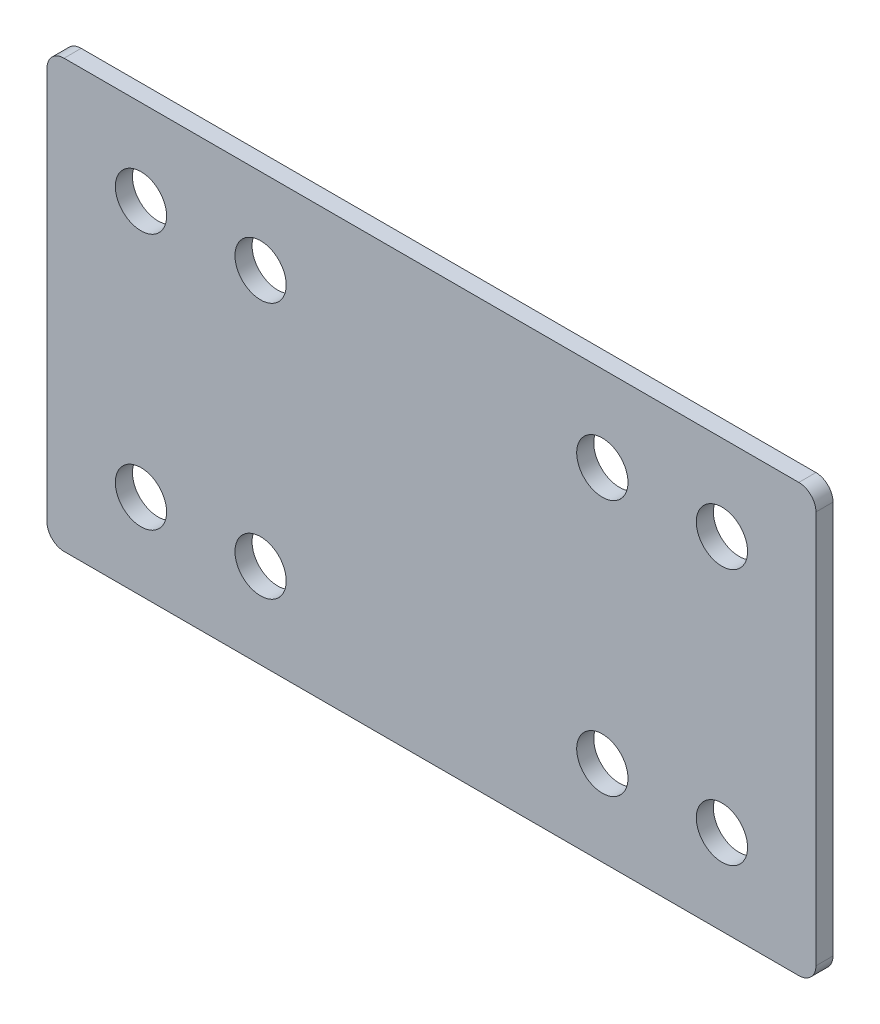
ISO-10303-21;
HEADER;
FILE_DESCRIPTION(('STEP AP214'),'2;1');
FILE_NAME('part.step','',(''),(''),'','','');
FILE_SCHEMA(('AUTOMOTIVE_DESIGN { 1 0 10303 214 1 1 1 1 }'));
ENDSEC;
DATA;
#1=APPLICATION_CONTEXT('core data for automotive mechanical design processes');
#2=APPLICATION_PROTOCOL_DEFINITION('international standard','automotive_design',2000,#1);
#3=PRODUCT_CONTEXT('',#1,'mechanical');
#4=PRODUCT('Part','Part','',(#3));
#5=PRODUCT_RELATED_PRODUCT_CATEGORY('part','',(#4));
#6=PRODUCT_DEFINITION_FORMATION('','',#4);
#7=PRODUCT_DEFINITION_CONTEXT('part definition',#1,'design');
#8=PRODUCT_DEFINITION('design','',#6,#7);
#9=PRODUCT_DEFINITION_SHAPE('','',#8);
#10=(LENGTH_UNIT() NAMED_UNIT(*) SI_UNIT(.MILLI.,.METRE.));
#11=(NAMED_UNIT(*) PLANE_ANGLE_UNIT() SI_UNIT($,.RADIAN.));
#12=(NAMED_UNIT(*) SI_UNIT($,.STERADIAN.) SOLID_ANGLE_UNIT());
#13=UNCERTAINTY_MEASURE_WITH_UNIT(LENGTH_MEASURE(1.E-05),#10,'distance_accuracy_value','');
#14=(GEOMETRIC_REPRESENTATION_CONTEXT(3) GLOBAL_UNCERTAINTY_ASSIGNED_CONTEXT((#13)) GLOBAL_UNIT_ASSIGNED_CONTEXT((#10,
#11,#12)) REPRESENTATION_CONTEXT('',''));
#15=CARTESIAN_POINT('',(0.,0.,0.));
#16=DIRECTION('',(0.,0.,1.));
#17=DIRECTION('',(1.,0.,0.));
#18=AXIS2_PLACEMENT_3D('',#15,#16,#17);
#19=CARTESIAN_POINT('',(22.5,-12.5,1.));
#20=DIRECTION('',(-1.,0.,0.));
#21=DIRECTION('',(0.,0.,1.));
#22=AXIS2_PLACEMENT_3D('',#19,#20,#21);
#23=PLANE('',#22);
#24=DIRECTION('',(0.,1.,0.));
#25=VECTOR('',#24,1.);
#26=CARTESIAN_POINT('',(22.5,-12.5,1.));
#27=LINE('',#26,#25);
#28=CARTESIAN_POINT('',(22.5,-11.5,1.));
#29=VERTEX_POINT('',#28);
#30=CARTESIAN_POINT('',(22.5,11.5,1.));
#31=VERTEX_POINT('',#30);
#32=EDGE_CURVE('E129',#29,#31,#27,.T.);
#33=ORIENTED_EDGE('',*,*,#32,.F.);
#34=DIRECTION('',(0.,0.,-1.));
#35=VECTOR('',#34,1.);
#36=CARTESIAN_POINT('',(22.5,-11.5,1.));
#37=LINE('',#36,#35);
#38=CARTESIAN_POINT('',(22.5,-11.5,0.));
#39=VERTEX_POINT('',#38);
#40=EDGE_CURVE('E11',#29,#39,#37,.T.);
#41=ORIENTED_EDGE('',*,*,#40,.T.);
#42=DIRECTION('',(0.,1.,0.));
#43=VECTOR('',#42,1.);
#44=CARTESIAN_POINT('',(22.5,-12.5,0.));
#45=LINE('',#44,#43);
#46=CARTESIAN_POINT('',(22.5,11.5,0.));
#47=VERTEX_POINT('',#46);
#48=EDGE_CURVE('E160',#39,#47,#45,.T.);
#49=ORIENTED_EDGE('',*,*,#48,.T.);
#50=DIRECTION('',(0.,0.,-1.));
#51=VECTOR('',#50,1.);
#52=CARTESIAN_POINT('',(22.5,11.5,1.));
#53=LINE('',#52,#51);
#54=EDGE_CURVE('E43',#47,#31,#53,.F.);
#55=ORIENTED_EDGE('',*,*,#54,.T.);
#56=EDGE_LOOP('',(#33,#41,#49,#55));
#57=FACE_BOUND('',#56,.T.);
#58=ADVANCED_FACE('F35',(#57),#23,.F.);
#59=CARTESIAN_POINT('',(-22.5,12.5,1.));
#60=DIRECTION('',(0.,-1.,0.));
#61=DIRECTION('',(0.,0.,-1.));
#62=AXIS2_PLACEMENT_3D('',#59,#60,#61);
#63=PLANE('',#62);
#64=DIRECTION('',(-1.,0.,0.));
#65=VECTOR('',#64,1.);
#66=CARTESIAN_POINT('',(-22.5,12.5,0.));
#67=LINE('',#66,#65);
#68=CARTESIAN_POINT('',(21.5,12.5,0.));
#69=VERTEX_POINT('',#68);
#70=CARTESIAN_POINT('',(-21.5,12.5,0.));
#71=VERTEX_POINT('',#70);
#72=EDGE_CURVE('E134',#69,#71,#67,.T.);
#73=ORIENTED_EDGE('',*,*,#72,.T.);
#74=DIRECTION('',(0.,0.,-1.));
#75=VECTOR('',#74,1.);
#76=CARTESIAN_POINT('',(-21.5,12.5,1.));
#77=LINE('',#76,#75);
#78=CARTESIAN_POINT('',(-21.5,12.5,1.));
#79=VERTEX_POINT('',#78);
#80=EDGE_CURVE('E50',#71,#79,#77,.F.);
#81=ORIENTED_EDGE('',*,*,#80,.T.);
#82=DIRECTION('',(-1.,0.,0.));
#83=VECTOR('',#82,1.);
#84=CARTESIAN_POINT('',(-22.5,12.5,1.));
#85=LINE('',#84,#83);
#86=CARTESIAN_POINT('',(21.5,12.5,1.));
#87=VERTEX_POINT('',#86);
#88=EDGE_CURVE('E132',#87,#79,#85,.T.);
#89=ORIENTED_EDGE('',*,*,#88,.F.);
#90=DIRECTION('',(0.,0.,-1.));
#91=VECTOR('',#90,1.);
#92=CARTESIAN_POINT('',(21.5,12.5,1.));
#93=LINE('',#92,#91);
#94=EDGE_CURVE('E152',#87,#69,#93,.T.);
#95=ORIENTED_EDGE('',*,*,#94,.T.);
#96=EDGE_LOOP('',(#73,#81,#89,#95));
#97=FACE_BOUND('',#96,.T.);
#98=ADVANCED_FACE('F167',(#97),#63,.F.);
#99=CARTESIAN_POINT('',(-22.5,-12.5,1.));
#100=DIRECTION('',(1.,0.,0.));
#101=DIRECTION('',(0.,0.,-1.));
#102=AXIS2_PLACEMENT_3D('',#99,#100,#101);
#103=PLANE('',#102);
#104=DIRECTION('',(0.,-1.,0.));
#105=VECTOR('',#104,1.);
#106=CARTESIAN_POINT('',(-22.5,-12.5,0.));
#107=LINE('',#106,#105);
#108=CARTESIAN_POINT('',(-22.5,11.5,0.));
#109=VERTEX_POINT('',#108);
#110=CARTESIAN_POINT('',(-22.5,-11.5,0.));
#111=VERTEX_POINT('',#110);
#112=EDGE_CURVE('E130',#109,#111,#107,.T.);
#113=ORIENTED_EDGE('',*,*,#112,.T.);
#114=DIRECTION('',(0.,0.,-1.));
#115=VECTOR('',#114,1.);
#116=CARTESIAN_POINT('',(-22.5,-11.5,1.));
#117=LINE('',#116,#115);
#118=CARTESIAN_POINT('',(-22.5,-11.5,1.));
#119=VERTEX_POINT('',#118);
#120=EDGE_CURVE('E107',#111,#119,#117,.F.);
#121=ORIENTED_EDGE('',*,*,#120,.T.);
#122=DIRECTION('',(0.,-1.,0.));
#123=VECTOR('',#122,1.);
#124=CARTESIAN_POINT('',(-22.5,-12.5,1.));
#125=LINE('',#124,#123);
#126=CARTESIAN_POINT('',(-22.5,11.5,1.));
#127=VERTEX_POINT('',#126);
#128=EDGE_CURVE('E172',#127,#119,#125,.T.);
#129=ORIENTED_EDGE('',*,*,#128,.F.);
#130=DIRECTION('',(0.,0.,-1.));
#131=VECTOR('',#130,1.);
#132=CARTESIAN_POINT('',(-22.5,11.5,1.));
#133=LINE('',#132,#131);
#134=EDGE_CURVE('E112',#127,#109,#133,.T.);
#135=ORIENTED_EDGE('',*,*,#134,.T.);
#136=EDGE_LOOP('',(#113,#121,#129,#135));
#137=FACE_BOUND('',#136,.T.);
#138=ADVANCED_FACE('F268',(#137),#103,.F.);
#139=CARTESIAN_POINT('',(-22.5,-12.5,1.));
#140=DIRECTION('',(0.,1.,0.));
#141=DIRECTION('',(0.,0.,1.));
#142=AXIS2_PLACEMENT_3D('',#139,#140,#141);
#143=PLANE('',#142);
#144=DIRECTION('',(1.,0.,0.));
#145=VECTOR('',#144,1.);
#146=CARTESIAN_POINT('',(-22.5,-12.5,1.));
#147=LINE('',#146,#145);
#148=CARTESIAN_POINT('',(-21.5,-12.5,1.));
#149=VERTEX_POINT('',#148);
#150=CARTESIAN_POINT('',(21.5,-12.5,1.));
#151=VERTEX_POINT('',#150);
#152=EDGE_CURVE('E122',#149,#151,#147,.T.);
#153=ORIENTED_EDGE('',*,*,#152,.F.);
#154=DIRECTION('',(0.,0.,-1.));
#155=VECTOR('',#154,1.);
#156=CARTESIAN_POINT('',(-21.5,-12.5,1.));
#157=LINE('',#156,#155);
#158=CARTESIAN_POINT('',(-21.5,-12.5,0.));
#159=VERTEX_POINT('',#158);
#160=EDGE_CURVE('E106',#149,#159,#157,.T.);
#161=ORIENTED_EDGE('',*,*,#160,.T.);
#162=DIRECTION('',(1.,0.,0.));
#163=VECTOR('',#162,1.);
#164=CARTESIAN_POINT('',(-22.5,-12.5,0.));
#165=LINE('',#164,#163);
#166=CARTESIAN_POINT('',(21.5,-12.5,0.));
#167=VERTEX_POINT('',#166);
#168=EDGE_CURVE('E119',#159,#167,#165,.T.);
#169=ORIENTED_EDGE('',*,*,#168,.T.);
#170=DIRECTION('',(0.,0.,-1.));
#171=VECTOR('',#170,1.);
#172=CARTESIAN_POINT('',(21.5,-12.5,1.));
#173=LINE('',#172,#171);
#174=EDGE_CURVE('E124',#167,#151,#173,.F.);
#175=ORIENTED_EDGE('',*,*,#174,.T.);
#176=EDGE_LOOP('',(#153,#161,#169,#175));
#177=FACE_BOUND('',#176,.T.);
#178=ADVANCED_FACE('F118',(#177),#143,.F.);
#179=CARTESIAN_POINT('',(0.,0.,1.));
#180=DIRECTION('',(0.,0.,-1.));
#181=DIRECTION('',(-1.,0.,0.));
#182=AXIS2_PLACEMENT_3D('',#179,#180,#181);
#183=PLANE('',#182);
#184=CARTESIAN_POINT('',(10.,-7.5,1.));
#185=DIRECTION('',(0.,0.,1.));
#186=DIRECTION('',(1.,0.,0.));
#187=AXIS2_PLACEMENT_3D('',#184,#185,#186);
#188=CIRCLE('',#187,1.5);
#189=CARTESIAN_POINT('',(11.5,-7.5,1.));
#190=VERTEX_POINT('',#189);
#191=EDGE_CURVE('E217',#190,#190,#188,.T.);
#192=ORIENTED_EDGE('',*,*,#191,.F.);
#193=EDGE_LOOP('',(#192));
#194=FACE_BOUND('',#193,.T.);
#195=CARTESIAN_POINT('',(-10.,-7.5,1.));
#196=DIRECTION('',(0.,0.,1.));
#197=DIRECTION('',(1.,0.,0.));
#198=AXIS2_PLACEMENT_3D('',#195,#196,#197);
#199=CIRCLE('',#198,1.5);
#200=CARTESIAN_POINT('',(-8.5,-7.5,1.));
#201=VERTEX_POINT('',#200);
#202=EDGE_CURVE('E211',#201,#201,#199,.T.);
#203=ORIENTED_EDGE('',*,*,#202,.F.);
#204=EDGE_LOOP('',(#203));
#205=FACE_BOUND('',#204,.T.);
#206=CARTESIAN_POINT('',(-17.,-7.5,1.));
#207=DIRECTION('',(0.,0.,1.));
#208=DIRECTION('',(1.,0.,0.));
#209=AXIS2_PLACEMENT_3D('',#206,#207,#208);
#210=CIRCLE('',#209,1.5);
#211=CARTESIAN_POINT('',(-15.5,-7.5,1.));
#212=VERTEX_POINT('',#211);
#213=EDGE_CURVE('E205',#212,#212,#210,.T.);
#214=ORIENTED_EDGE('',*,*,#213,.F.);
#215=EDGE_LOOP('',(#214));
#216=FACE_BOUND('',#215,.T.);
#217=CARTESIAN_POINT('',(17.,-7.5,1.));
#218=DIRECTION('',(0.,0.,1.));
#219=DIRECTION('',(1.,0.,0.));
#220=AXIS2_PLACEMENT_3D('',#217,#218,#219);
#221=CIRCLE('',#220,1.5);
#222=CARTESIAN_POINT('',(18.5,-7.5,1.));
#223=VERTEX_POINT('',#222);
#224=EDGE_CURVE('E199',#223,#223,#221,.T.);
#225=ORIENTED_EDGE('',*,*,#224,.F.);
#226=EDGE_LOOP('',(#225));
#227=FACE_BOUND('',#226,.T.);
#228=CARTESIAN_POINT('',(17.,7.5,1.));
#229=DIRECTION('',(0.,0.,1.));
#230=DIRECTION('',(1.,0.,0.));
#231=AXIS2_PLACEMENT_3D('',#228,#229,#230);
#232=CIRCLE('',#231,1.5);
#233=CARTESIAN_POINT('',(18.5,7.5,1.));
#234=VERTEX_POINT('',#233);
#235=EDGE_CURVE('E193',#234,#234,#232,.T.);
#236=ORIENTED_EDGE('',*,*,#235,.F.);
#237=EDGE_LOOP('',(#236));
#238=FACE_BOUND('',#237,.T.);
#239=CARTESIAN_POINT('',(10.,7.5,1.));
#240=DIRECTION('',(0.,0.,1.));
#241=DIRECTION('',(1.,0.,0.));
#242=AXIS2_PLACEMENT_3D('',#239,#240,#241);
#243=CIRCLE('',#242,1.5);
#244=CARTESIAN_POINT('',(11.5,7.5,1.));
#245=VERTEX_POINT('',#244);
#246=EDGE_CURVE('E187',#245,#245,#243,.T.);
#247=ORIENTED_EDGE('',*,*,#246,.F.);
#248=EDGE_LOOP('',(#247));
#249=FACE_BOUND('',#248,.T.);
#250=CARTESIAN_POINT('',(-10.,7.5,1.));
#251=DIRECTION('',(0.,0.,1.));
#252=DIRECTION('',(1.,0.,0.));
#253=AXIS2_PLACEMENT_3D('',#250,#251,#252);
#254=CIRCLE('',#253,1.5);
#255=CARTESIAN_POINT('',(-8.5,7.5,1.));
#256=VERTEX_POINT('',#255);
#257=EDGE_CURVE('E181',#256,#256,#254,.T.);
#258=ORIENTED_EDGE('',*,*,#257,.F.);
#259=EDGE_LOOP('',(#258));
#260=FACE_BOUND('',#259,.T.);
#261=CARTESIAN_POINT('',(-17.,7.5,1.));
#262=DIRECTION('',(0.,0.,1.));
#263=DIRECTION('',(1.,0.,0.));
#264=AXIS2_PLACEMENT_3D('',#261,#262,#263);
#265=CIRCLE('',#264,1.5);
#266=CARTESIAN_POINT('',(-15.5,7.5,1.));
#267=VERTEX_POINT('',#266);
#268=EDGE_CURVE('E175',#267,#267,#265,.T.);
#269=ORIENTED_EDGE('',*,*,#268,.F.);
#270=EDGE_LOOP('',(#269));
#271=FACE_BOUND('',#270,.T.);
#272=ORIENTED_EDGE('',*,*,#128,.T.);
#273=CARTESIAN_POINT('',(-21.5,-11.5,1.));
#274=DIRECTION('',(0.,0.,-1.));
#275=DIRECTION('',(-1.,0.,0.));
#276=AXIS2_PLACEMENT_3D('',#273,#274,#275);
#277=CIRCLE('',#276,1.);
#278=EDGE_CURVE('E150',#119,#149,#277,.F.);
#279=ORIENTED_EDGE('',*,*,#278,.T.);
#280=ORIENTED_EDGE('',*,*,#152,.T.);
#281=CARTESIAN_POINT('',(21.5,-11.5,1.));
#282=DIRECTION('',(0.,0.,-1.));
#283=DIRECTION('',(-1.,0.,0.));
#284=AXIS2_PLACEMENT_3D('',#281,#282,#283);
#285=CIRCLE('',#284,1.);
#286=EDGE_CURVE('E146',#151,#29,#285,.F.);
#287=ORIENTED_EDGE('',*,*,#286,.T.);
#288=ORIENTED_EDGE('',*,*,#32,.T.);
#289=CARTESIAN_POINT('',(21.5,11.5,1.));
#290=DIRECTION('',(0.,0.,-1.));
#291=DIRECTION('',(-1.,0.,0.));
#292=AXIS2_PLACEMENT_3D('',#289,#290,#291);
#293=CIRCLE('',#292,1.);
#294=EDGE_CURVE('E57',#31,#87,#293,.F.);
#295=ORIENTED_EDGE('',*,*,#294,.T.);
#296=ORIENTED_EDGE('',*,*,#88,.T.);
#297=CARTESIAN_POINT('',(-21.5,11.5,1.));
#298=DIRECTION('',(0.,0.,-1.));
#299=DIRECTION('',(-1.,0.,0.));
#300=AXIS2_PLACEMENT_3D('',#297,#298,#299);
#301=CIRCLE('',#300,1.);
#302=EDGE_CURVE('E148',#79,#127,#301,.F.);
#303=ORIENTED_EDGE('',*,*,#302,.T.);
#304=EDGE_LOOP('',(#272,#279,#280,#287,#288,#295,#296,#303));
#305=FACE_BOUND('',#304,.T.);
#306=ADVANCED_FACE('F163',(#194,#205,#216,#227,#238,#249,#260,#271,#305),#183,.F.);
#307=CARTESIAN_POINT('',(0.,0.,0.));
#308=DIRECTION('',(0.,0.,-1.));
#309=DIRECTION('',(-1.,0.,0.));
#310=AXIS2_PLACEMENT_3D('',#307,#308,#309);
#311=PLANE('',#310);
#312=CARTESIAN_POINT('',(10.,-7.5,0.));
#313=DIRECTION('',(0.,0.,1.));
#314=DIRECTION('',(1.,0.,0.));
#315=AXIS2_PLACEMENT_3D('',#312,#313,#314);
#316=CIRCLE('',#315,1.5);
#317=CARTESIAN_POINT('',(11.5,-7.5,0.));
#318=VERTEX_POINT('',#317);
#319=EDGE_CURVE('E214',#318,#318,#316,.T.);
#320=ORIENTED_EDGE('',*,*,#319,.T.);
#321=EDGE_LOOP('',(#320));
#322=FACE_BOUND('',#321,.T.);
#323=CARTESIAN_POINT('',(-10.,-7.5,0.));
#324=DIRECTION('',(0.,0.,1.));
#325=DIRECTION('',(1.,0.,0.));
#326=AXIS2_PLACEMENT_3D('',#323,#324,#325);
#327=CIRCLE('',#326,1.5);
#328=CARTESIAN_POINT('',(-8.5,-7.5,0.));
#329=VERTEX_POINT('',#328);
#330=EDGE_CURVE('E208',#329,#329,#327,.T.);
#331=ORIENTED_EDGE('',*,*,#330,.T.);
#332=EDGE_LOOP('',(#331));
#333=FACE_BOUND('',#332,.T.);
#334=CARTESIAN_POINT('',(-17.,-7.5,0.));
#335=DIRECTION('',(0.,0.,1.));
#336=DIRECTION('',(1.,0.,0.));
#337=AXIS2_PLACEMENT_3D('',#334,#335,#336);
#338=CIRCLE('',#337,1.5);
#339=CARTESIAN_POINT('',(-15.5,-7.5,0.));
#340=VERTEX_POINT('',#339);
#341=EDGE_CURVE('E202',#340,#340,#338,.T.);
#342=ORIENTED_EDGE('',*,*,#341,.T.);
#343=EDGE_LOOP('',(#342));
#344=FACE_BOUND('',#343,.T.);
#345=CARTESIAN_POINT('',(17.,-7.5,0.));
#346=DIRECTION('',(0.,0.,1.));
#347=DIRECTION('',(1.,0.,0.));
#348=AXIS2_PLACEMENT_3D('',#345,#346,#347);
#349=CIRCLE('',#348,1.5);
#350=CARTESIAN_POINT('',(18.5,-7.5,0.));
#351=VERTEX_POINT('',#350);
#352=EDGE_CURVE('E196',#351,#351,#349,.T.);
#353=ORIENTED_EDGE('',*,*,#352,.T.);
#354=EDGE_LOOP('',(#353));
#355=FACE_BOUND('',#354,.T.);
#356=CARTESIAN_POINT('',(17.,7.5,0.));
#357=DIRECTION('',(0.,0.,1.));
#358=DIRECTION('',(1.,0.,0.));
#359=AXIS2_PLACEMENT_3D('',#356,#357,#358);
#360=CIRCLE('',#359,1.5);
#361=CARTESIAN_POINT('',(18.5,7.5,0.));
#362=VERTEX_POINT('',#361);
#363=EDGE_CURVE('E190',#362,#362,#360,.T.);
#364=ORIENTED_EDGE('',*,*,#363,.T.);
#365=EDGE_LOOP('',(#364));
#366=FACE_BOUND('',#365,.T.);
#367=CARTESIAN_POINT('',(10.,7.5,0.));
#368=DIRECTION('',(0.,0.,1.));
#369=DIRECTION('',(1.,0.,0.));
#370=AXIS2_PLACEMENT_3D('',#367,#368,#369);
#371=CIRCLE('',#370,1.5);
#372=CARTESIAN_POINT('',(11.5,7.5,0.));
#373=VERTEX_POINT('',#372);
#374=EDGE_CURVE('E184',#373,#373,#371,.T.);
#375=ORIENTED_EDGE('',*,*,#374,.T.);
#376=EDGE_LOOP('',(#375));
#377=FACE_BOUND('',#376,.T.);
#378=CARTESIAN_POINT('',(-10.,7.5,0.));
#379=DIRECTION('',(0.,0.,1.));
#380=DIRECTION('',(1.,0.,0.));
#381=AXIS2_PLACEMENT_3D('',#378,#379,#380);
#382=CIRCLE('',#381,1.5);
#383=CARTESIAN_POINT('',(-8.5,7.5,0.));
#384=VERTEX_POINT('',#383);
#385=EDGE_CURVE('E178',#384,#384,#382,.T.);
#386=ORIENTED_EDGE('',*,*,#385,.T.);
#387=EDGE_LOOP('',(#386));
#388=FACE_BOUND('',#387,.T.);
#389=CARTESIAN_POINT('',(-17.,7.5,0.));
#390=DIRECTION('',(0.,0.,1.));
#391=DIRECTION('',(1.,0.,0.));
#392=AXIS2_PLACEMENT_3D('',#389,#390,#391);
#393=CIRCLE('',#392,1.5);
#394=CARTESIAN_POINT('',(-15.5,7.5,0.));
#395=VERTEX_POINT('',#394);
#396=EDGE_CURVE('E168',#395,#395,#393,.T.);
#397=ORIENTED_EDGE('',*,*,#396,.T.);
#398=EDGE_LOOP('',(#397));
#399=FACE_BOUND('',#398,.T.);
#400=ORIENTED_EDGE('',*,*,#168,.F.);
#401=CARTESIAN_POINT('',(-21.5,-11.5,0.));
#402=DIRECTION('',(0.,0.,-1.));
#403=DIRECTION('',(-1.,0.,0.));
#404=AXIS2_PLACEMENT_3D('',#401,#402,#403);
#405=CIRCLE('',#404,1.);
#406=EDGE_CURVE('E102',#159,#111,#405,.T.);
#407=ORIENTED_EDGE('',*,*,#406,.T.);
#408=ORIENTED_EDGE('',*,*,#112,.F.);
#409=CARTESIAN_POINT('',(-21.5,11.5,0.));
#410=DIRECTION('',(0.,0.,-1.));
#411=DIRECTION('',(-1.,0.,0.));
#412=AXIS2_PLACEMENT_3D('',#409,#410,#411);
#413=CIRCLE('',#412,1.);
#414=EDGE_CURVE('E113',#109,#71,#413,.T.);
#415=ORIENTED_EDGE('',*,*,#414,.T.);
#416=ORIENTED_EDGE('',*,*,#72,.F.);
#417=CARTESIAN_POINT('',(21.5,11.5,0.));
#418=DIRECTION('',(0.,0.,-1.));
#419=DIRECTION('',(-1.,0.,0.));
#420=AXIS2_PLACEMENT_3D('',#417,#418,#419);
#421=CIRCLE('',#420,1.);
#422=EDGE_CURVE('E123',#69,#47,#421,.T.);
#423=ORIENTED_EDGE('',*,*,#422,.T.);
#424=ORIENTED_EDGE('',*,*,#48,.F.);
#425=CARTESIAN_POINT('',(21.5,-11.5,0.));
#426=DIRECTION('',(0.,0.,-1.));
#427=DIRECTION('',(-1.,0.,0.));
#428=AXIS2_PLACEMENT_3D('',#425,#426,#427);
#429=CIRCLE('',#428,1.);
#430=EDGE_CURVE('E128',#39,#167,#429,.T.);
#431=ORIENTED_EDGE('',*,*,#430,.T.);
#432=EDGE_LOOP('',(#400,#407,#408,#415,#416,#423,#424,#431));
#433=FACE_BOUND('',#432,.T.);
#434=ADVANCED_FACE('F126',(#322,#333,#344,#355,#366,#377,#388,#399,#433),#311,.T.);
#435=CARTESIAN_POINT('',(-17.,7.5,0.));
#436=DIRECTION('',(0.,0.,1.));
#437=DIRECTION('',(1.,0.,0.));
#438=AXIS2_PLACEMENT_3D('',#435,#436,#437);
#439=CYLINDRICAL_SURFACE('',#438,1.5);
#440=ORIENTED_EDGE('',*,*,#396,.F.);
#441=EDGE_LOOP('',(#440));
#442=FACE_BOUND('',#441,.T.);
#443=ORIENTED_EDGE('',*,*,#268,.T.);
#444=EDGE_LOOP('',(#443));
#445=FACE_BOUND('',#444,.T.);
#446=ADVANCED_FACE('F249',(#442,#445),#439,.F.);
#447=CARTESIAN_POINT('',(-10.,7.5,0.));
#448=DIRECTION('',(0.,0.,1.));
#449=DIRECTION('',(1.,0.,0.));
#450=AXIS2_PLACEMENT_3D('',#447,#448,#449);
#451=CYLINDRICAL_SURFACE('',#450,1.5);
#452=ORIENTED_EDGE('',*,*,#385,.F.);
#453=EDGE_LOOP('',(#452));
#454=FACE_BOUND('',#453,.T.);
#455=ORIENTED_EDGE('',*,*,#257,.T.);
#456=EDGE_LOOP('',(#455));
#457=FACE_BOUND('',#456,.T.);
#458=ADVANCED_FACE('F251',(#454,#457),#451,.F.);
#459=CARTESIAN_POINT('',(10.,7.5,0.));
#460=DIRECTION('',(0.,0.,1.));
#461=DIRECTION('',(1.,0.,0.));
#462=AXIS2_PLACEMENT_3D('',#459,#460,#461);
#463=CYLINDRICAL_SURFACE('',#462,1.5);
#464=ORIENTED_EDGE('',*,*,#374,.F.);
#465=EDGE_LOOP('',(#464));
#466=FACE_BOUND('',#465,.T.);
#467=ORIENTED_EDGE('',*,*,#246,.T.);
#468=EDGE_LOOP('',(#467));
#469=FACE_BOUND('',#468,.T.);
#470=ADVANCED_FACE('F258',(#466,#469),#463,.F.);
#471=CARTESIAN_POINT('',(17.,7.5,0.));
#472=DIRECTION('',(0.,0.,1.));
#473=DIRECTION('',(1.,0.,0.));
#474=AXIS2_PLACEMENT_3D('',#471,#472,#473);
#475=CYLINDRICAL_SURFACE('',#474,1.5);
#476=ORIENTED_EDGE('',*,*,#363,.F.);
#477=EDGE_LOOP('',(#476));
#478=FACE_BOUND('',#477,.T.);
#479=ORIENTED_EDGE('',*,*,#235,.T.);
#480=EDGE_LOOP('',(#479));
#481=FACE_BOUND('',#480,.T.);
#482=ADVANCED_FACE('F353',(#478,#481),#475,.F.);
#483=CARTESIAN_POINT('',(17.,-7.5,0.));
#484=DIRECTION('',(0.,0.,1.));
#485=DIRECTION('',(1.,0.,0.));
#486=AXIS2_PLACEMENT_3D('',#483,#484,#485);
#487=CYLINDRICAL_SURFACE('',#486,1.5);
#488=ORIENTED_EDGE('',*,*,#352,.F.);
#489=EDGE_LOOP('',(#488));
#490=FACE_BOUND('',#489,.T.);
#491=ORIENTED_EDGE('',*,*,#224,.T.);
#492=EDGE_LOOP('',(#491));
#493=FACE_BOUND('',#492,.T.);
#494=ADVANCED_FACE('F345',(#490,#493),#487,.F.);
#495=CARTESIAN_POINT('',(-17.,-7.5,0.));
#496=DIRECTION('',(0.,0.,1.));
#497=DIRECTION('',(1.,0.,0.));
#498=AXIS2_PLACEMENT_3D('',#495,#496,#497);
#499=CYLINDRICAL_SURFACE('',#498,1.5);
#500=ORIENTED_EDGE('',*,*,#341,.F.);
#501=EDGE_LOOP('',(#500));
#502=FACE_BOUND('',#501,.T.);
#503=ORIENTED_EDGE('',*,*,#213,.T.);
#504=EDGE_LOOP('',(#503));
#505=FACE_BOUND('',#504,.T.);
#506=ADVANCED_FACE('F337',(#502,#505),#499,.F.);
#507=CARTESIAN_POINT('',(-10.,-7.5,0.));
#508=DIRECTION('',(0.,0.,1.));
#509=DIRECTION('',(1.,0.,0.));
#510=AXIS2_PLACEMENT_3D('',#507,#508,#509);
#511=CYLINDRICAL_SURFACE('',#510,1.5);
#512=ORIENTED_EDGE('',*,*,#330,.F.);
#513=EDGE_LOOP('',(#512));
#514=FACE_BOUND('',#513,.T.);
#515=ORIENTED_EDGE('',*,*,#202,.T.);
#516=EDGE_LOOP('',(#515));
#517=FACE_BOUND('',#516,.T.);
#518=ADVANCED_FACE('F228',(#514,#517),#511,.F.);
#519=CARTESIAN_POINT('',(10.,-7.5,0.));
#520=DIRECTION('',(0.,0.,1.));
#521=DIRECTION('',(1.,0.,0.));
#522=AXIS2_PLACEMENT_3D('',#519,#520,#521);
#523=CYLINDRICAL_SURFACE('',#522,1.5);
#524=ORIENTED_EDGE('',*,*,#319,.F.);
#525=EDGE_LOOP('',(#524));
#526=FACE_BOUND('',#525,.T.);
#527=ORIENTED_EDGE('',*,*,#191,.T.);
#528=EDGE_LOOP('',(#527));
#529=FACE_BOUND('',#528,.T.);
#530=ADVANCED_FACE('F225',(#526,#529),#523,.F.);
#531=CARTESIAN_POINT('',(-21.5,-11.5,1.));
#532=DIRECTION('',(0.,0.,-1.));
#533=DIRECTION('',(-1.,0.,0.));
#534=AXIS2_PLACEMENT_3D('',#531,#532,#533);
#535=CYLINDRICAL_SURFACE('',#534,1.);
#536=ORIENTED_EDGE('',*,*,#278,.F.);
#537=ORIENTED_EDGE('',*,*,#120,.F.);
#538=ORIENTED_EDGE('',*,*,#406,.F.);
#539=ORIENTED_EDGE('',*,*,#160,.F.);
#540=EDGE_LOOP('',(#536,#537,#538,#539));
#541=FACE_BOUND('',#540,.T.);
#542=ADVANCED_FACE('F105',(#541),#535,.T.);
#543=CARTESIAN_POINT('',(-21.5,11.5,1.));
#544=DIRECTION('',(0.,0.,-1.));
#545=DIRECTION('',(-1.,0.,0.));
#546=AXIS2_PLACEMENT_3D('',#543,#544,#545);
#547=CYLINDRICAL_SURFACE('',#546,1.);
#548=ORIENTED_EDGE('',*,*,#302,.F.);
#549=ORIENTED_EDGE('',*,*,#80,.F.);
#550=ORIENTED_EDGE('',*,*,#414,.F.);
#551=ORIENTED_EDGE('',*,*,#134,.F.);
#552=EDGE_LOOP('',(#548,#549,#550,#551));
#553=FACE_BOUND('',#552,.T.);
#554=ADVANCED_FACE('F274',(#553),#547,.T.);
#555=CARTESIAN_POINT('',(21.5,-11.5,1.));
#556=DIRECTION('',(0.,0.,-1.));
#557=DIRECTION('',(-1.,0.,0.));
#558=AXIS2_PLACEMENT_3D('',#555,#556,#557);
#559=CYLINDRICAL_SURFACE('',#558,1.);
#560=ORIENTED_EDGE('',*,*,#286,.F.);
#561=ORIENTED_EDGE('',*,*,#174,.F.);
#562=ORIENTED_EDGE('',*,*,#430,.F.);
#563=ORIENTED_EDGE('',*,*,#40,.F.);
#564=EDGE_LOOP('',(#560,#561,#562,#563));
#565=FACE_BOUND('',#564,.T.);
#566=ADVANCED_FACE('F276',(#565),#559,.T.);
#567=CARTESIAN_POINT('',(21.5,11.5,1.));
#568=DIRECTION('',(0.,0.,-1.));
#569=DIRECTION('',(-1.,0.,0.));
#570=AXIS2_PLACEMENT_3D('',#567,#568,#569);
#571=CYLINDRICAL_SURFACE('',#570,1.);
#572=ORIENTED_EDGE('',*,*,#294,.F.);
#573=ORIENTED_EDGE('',*,*,#54,.F.);
#574=ORIENTED_EDGE('',*,*,#422,.F.);
#575=ORIENTED_EDGE('',*,*,#94,.F.);
#576=EDGE_LOOP('',(#572,#573,#574,#575));
#577=FACE_BOUND('',#576,.T.);
#578=ADVANCED_FACE('F37',(#577),#571,.T.);
#579=CLOSED_SHELL('',(#58,#98,#138,#178,#306,#434,#446,#458,#470,#482,#494,#506,#518,#530,#542,
#554,#566,#578));
#580=MANIFOLD_SOLID_BREP('B2',#579);
#581=ADVANCED_BREP_SHAPE_REPRESENTATION('',(#18,#580),#14);
#582=SHAPE_DEFINITION_REPRESENTATION(#9,#581);
ENDSEC;
END-ISO-10303-21;
